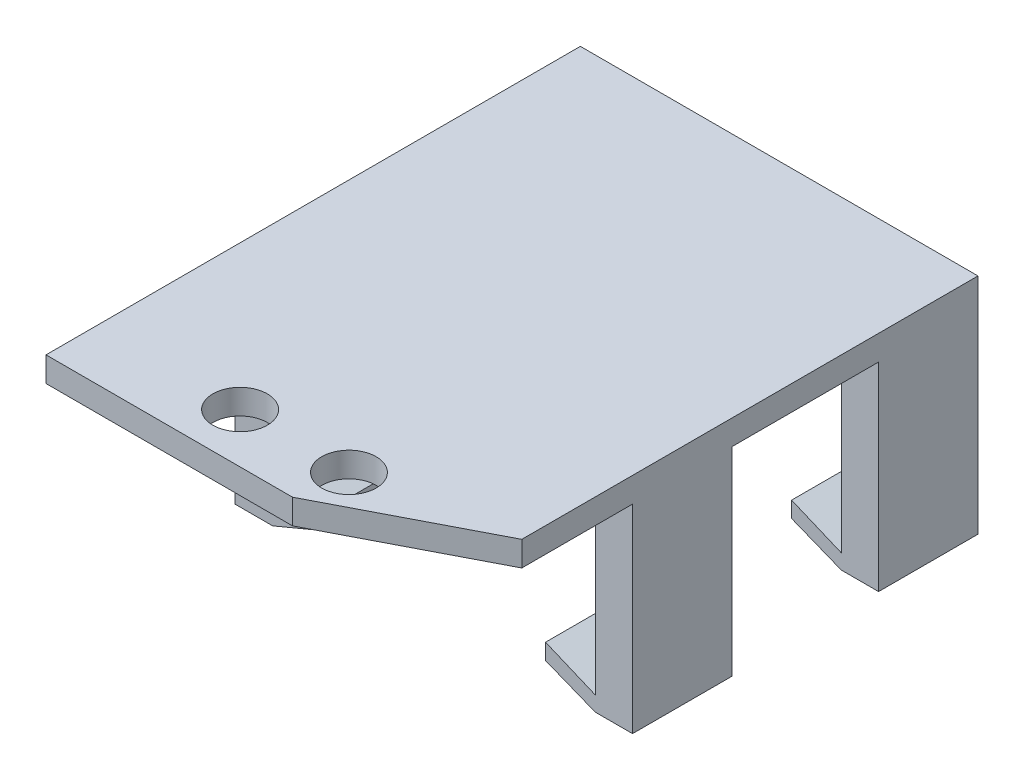
ISO-10303-21;
HEADER;
FILE_DESCRIPTION(('STEP AP214'),'2;1');
FILE_NAME('part.step','',(''),(''),'','','');
FILE_SCHEMA(('AUTOMOTIVE_DESIGN { 1 0 10303 214 1 1 1 1 }'));
ENDSEC;
DATA;
#1=APPLICATION_CONTEXT('core data for automotive mechanical design processes');
#2=APPLICATION_PROTOCOL_DEFINITION('international standard','automotive_design',2000,#1);
#3=PRODUCT_CONTEXT('',#1,'mechanical');
#4=PRODUCT('Part','Part','',(#3));
#5=PRODUCT_RELATED_PRODUCT_CATEGORY('part','',(#4));
#6=PRODUCT_DEFINITION_FORMATION('','',#4);
#7=PRODUCT_DEFINITION_CONTEXT('part definition',#1,'design');
#8=PRODUCT_DEFINITION('design','',#6,#7);
#9=PRODUCT_DEFINITION_SHAPE('','',#8);
#10=(LENGTH_UNIT() NAMED_UNIT(*) SI_UNIT(.MILLI.,.METRE.));
#11=(NAMED_UNIT(*) PLANE_ANGLE_UNIT() SI_UNIT($,.RADIAN.));
#12=(NAMED_UNIT(*) SI_UNIT($,.STERADIAN.) SOLID_ANGLE_UNIT());
#13=UNCERTAINTY_MEASURE_WITH_UNIT(LENGTH_MEASURE(1.E-05),#10,'distance_accuracy_value','');
#14=(GEOMETRIC_REPRESENTATION_CONTEXT(3) GLOBAL_UNCERTAINTY_ASSIGNED_CONTEXT((#13)) GLOBAL_UNIT_ASSIGNED_CONTEXT((#10,
#11,#12)) REPRESENTATION_CONTEXT('',''));
#15=CARTESIAN_POINT('',(0.,0.,0.));
#16=DIRECTION('',(0.,0.,1.));
#17=DIRECTION('',(1.,0.,0.));
#18=AXIS2_PLACEMENT_3D('',#15,#16,#17);
#19=CARTESIAN_POINT('',(0.,0.,0.));
#20=DIRECTION('',(0.,1.,0.));
#21=DIRECTION('',(0.,0.,1.));
#22=AXIS2_PLACEMENT_3D('',#19,#20,#21);
#23=PLANE('',#22);
#24=CARTESIAN_POINT('',(14.3653480916031,0.,37.0890162162027));
#25=DIRECTION('',(0.,1.,0.));
#26=DIRECTION('',(0.,0.,1.));
#27=AXIS2_PLACEMENT_3D('',#24,#25,#26);
#28=CIRCLE('',#27,2.7813);
#29=CARTESIAN_POINT('',(14.3653480916031,0.,39.8703162162027));
#30=VERTEX_POINT('',#29);
#31=EDGE_CURVE('E416',#30,#30,#28,.T.);
#32=ORIENTED_EDGE('',*,*,#31,.T.);
#33=EDGE_LOOP('',(#32));
#34=FACE_BOUND('',#33,.T.);
#35=CARTESIAN_POINT('',(3.24014809160307,0.,37.0890162162027));
#36=DIRECTION('',(0.,1.,0.));
#37=DIRECTION('',(0.,0.,1.));
#38=AXIS2_PLACEMENT_3D('',#35,#36,#37);
#39=CIRCLE('',#38,2.7813);
#40=CARTESIAN_POINT('',(3.24014809160307,0.,39.8703162162027));
#41=VERTEX_POINT('',#40);
#42=EDGE_CURVE('E420',#41,#41,#39,.T.);
#43=ORIENTED_EDGE('',*,*,#42,.T.);
#44=EDGE_LOOP('',(#43));
#45=FACE_BOUND('',#44,.T.);
#46=DIRECTION('',(0.888278607187186,0.,-0.459305035911423));
#47=VECTOR('',#46,1.);
#48=CARTESIAN_POINT('',(20.0901524205388,0.,38.8535966623628));
#49=LINE('',#48,#47);
#50=CARTESIAN_POINT('',(13.6782561135843,0.,42.1690162162027));
#51=VERTEX_POINT('',#50);
#52=CARTESIAN_POINT('',(29.1227480916031,0.,34.1830837787881));
#53=VERTEX_POINT('',#52);
#54=EDGE_CURVE('E51',#51,#53,#49,.T.);
#55=ORIENTED_EDGE('',*,*,#54,.F.);
#56=DIRECTION('',(1.,0.,0.));
#57=VECTOR('',#56,1.);
#58=CARTESIAN_POINT('',(18.8852561135843,0.,42.1690162162027));
#59=LINE('',#58,#57);
#60=CARTESIAN_POINT('',(-11.5172519083969,0.,42.1690162162027));
#61=VERTEX_POINT('',#60);
#62=EDGE_CURVE('E252',#61,#51,#59,.T.);
#63=ORIENTED_EDGE('',*,*,#62,.F.);
#64=DIRECTION('',(0.,0.,1.));
#65=VECTOR('',#64,1.);
#66=CARTESIAN_POINT('',(-11.5172519083969,0.,-12.4409837837973));
#67=LINE('',#66,#65);
#68=CARTESIAN_POINT('',(-11.5172519083969,0.,22.8650162162027));
#69=VERTEX_POINT('',#68);
#70=EDGE_CURVE('E268',#69,#61,#67,.T.);
#71=ORIENTED_EDGE('',*,*,#70,.F.);
#72=DIRECTION('',(-1.,0.,0.));
#73=VECTOR('',#72,1.);
#74=CARTESIAN_POINT('',(-11.5172519083969,0.,22.8650162162027));
#75=LINE('',#74,#73);
#76=CARTESIAN_POINT('',(29.1227480916031,0.,22.8650162162027));
#77=VERTEX_POINT('',#76);
#78=EDGE_CURVE('E378',#77,#69,#75,.T.);
#79=ORIENTED_EDGE('',*,*,#78,.F.);
#80=DIRECTION('',(0.,0.,-1.));
#81=VECTOR('',#80,1.);
#82=CARTESIAN_POINT('',(29.1227480916031,0.,-12.4409837837973));
#83=LINE('',#82,#81);
#84=EDGE_CURVE('E262',#53,#77,#83,.T.);
#85=ORIENTED_EDGE('',*,*,#84,.F.);
#86=EDGE_LOOP('',(#55,#63,#71,#79,#85));
#87=FACE_BOUND('',#86,.T.);
#88=ADVANCED_FACE('F37',(#34,#45,#87),#23,.F.);
#89=CARTESIAN_POINT('',(0.,2.54,0.));
#90=DIRECTION('',(0.,1.,0.));
#91=DIRECTION('',(0.,0.,1.));
#92=AXIS2_PLACEMENT_3D('',#89,#90,#91);
#93=PLANE('',#92);
#94=CARTESIAN_POINT('',(3.24014809160307,2.54,37.0890162162027));
#95=DIRECTION('',(0.,1.,0.));
#96=DIRECTION('',(0.,0.,1.));
#97=AXIS2_PLACEMENT_3D('',#94,#95,#96);
#98=CIRCLE('',#97,2.7813);
#99=CARTESIAN_POINT('',(3.24014809160307,2.54,39.8703162162027));
#100=VERTEX_POINT('',#99);
#101=EDGE_CURVE('E270',#100,#100,#98,.T.);
#102=ORIENTED_EDGE('',*,*,#101,.F.);
#103=EDGE_LOOP('',(#102));
#104=FACE_BOUND('',#103,.T.);
#105=CARTESIAN_POINT('',(14.3653480916031,2.54,37.0890162162027));
#106=DIRECTION('',(0.,1.,0.));
#107=DIRECTION('',(0.,0.,1.));
#108=AXIS2_PLACEMENT_3D('',#105,#106,#107);
#109=CIRCLE('',#108,2.7813);
#110=CARTESIAN_POINT('',(14.3653480916031,2.54,39.8703162162027));
#111=VERTEX_POINT('',#110);
#112=EDGE_CURVE('E417',#111,#111,#109,.T.);
#113=ORIENTED_EDGE('',*,*,#112,.F.);
#114=EDGE_LOOP('',(#113));
#115=FACE_BOUND('',#114,.T.);
#116=DIRECTION('',(1.,0.,0.));
#117=VECTOR('',#116,1.);
#118=CARTESIAN_POINT('',(-11.5172519083969,2.54,42.1690162162027));
#119=LINE('',#118,#117);
#120=CARTESIAN_POINT('',(-11.5172519083969,2.54,42.1690162162027));
#121=VERTEX_POINT('',#120);
#122=CARTESIAN_POINT('',(13.6782561135843,2.54,42.1690162162027));
#123=VERTEX_POINT('',#122);
#124=EDGE_CURVE('E249',#121,#123,#119,.T.);
#125=ORIENTED_EDGE('',*,*,#124,.T.);
#126=DIRECTION('',(0.888278607187186,0.,-0.459305035911423));
#127=VECTOR('',#126,1.);
#128=CARTESIAN_POINT('',(20.0901524205388,2.54,38.8535966623628));
#129=LINE('',#128,#127);
#130=CARTESIAN_POINT('',(29.1227480916031,2.54,34.1830837787881));
#131=VERTEX_POINT('',#130);
#132=EDGE_CURVE('E237',#123,#131,#129,.T.);
#133=ORIENTED_EDGE('',*,*,#132,.T.);
#134=DIRECTION('',(0.,0.,-1.));
#135=VECTOR('',#134,1.);
#136=CARTESIAN_POINT('',(29.1227480916031,2.54,42.1690162162027));
#137=LINE('',#136,#135);
#138=CARTESIAN_POINT('',(29.1227480916031,2.54,-12.4409837837973));
#139=VERTEX_POINT('',#138);
#140=EDGE_CURVE('E258',#131,#139,#137,.T.);
#141=ORIENTED_EDGE('',*,*,#140,.T.);
#142=DIRECTION('',(-1.,0.,0.));
#143=VECTOR('',#142,1.);
#144=CARTESIAN_POINT('',(-11.5172519083969,2.54,-12.4409837837973));
#145=LINE('',#144,#143);
#146=CARTESIAN_POINT('',(-11.5172519083969,2.54,-12.4409837837973));
#147=VERTEX_POINT('',#146);
#148=EDGE_CURVE('E260',#139,#147,#145,.T.);
#149=ORIENTED_EDGE('',*,*,#148,.T.);
#150=DIRECTION('',(0.,0.,1.));
#151=VECTOR('',#150,1.);
#152=CARTESIAN_POINT('',(-11.5172519083969,2.54,-12.4409837837973));
#153=LINE('',#152,#151);
#154=EDGE_CURVE('E256',#147,#121,#153,.T.);
#155=ORIENTED_EDGE('',*,*,#154,.T.);
#156=EDGE_LOOP('',(#125,#133,#141,#149,#155));
#157=FACE_BOUND('',#156,.T.);
#158=ADVANCED_FACE('F254',(#104,#115,#157),#93,.T.);
#159=CARTESIAN_POINT('',(18.8852561135843,2.54,42.1690162162027));
#160=DIRECTION('',(0.,0.,-1.));
#161=DIRECTION('',(-1.,0.,0.));
#162=AXIS2_PLACEMENT_3D('',#159,#160,#161);
#163=PLANE('',#162);
#164=DIRECTION('',(0.,1.,0.));
#165=VECTOR('',#164,1.);
#166=CARTESIAN_POINT('',(13.6782561135843,-20.32,42.1690162162027));
#167=LINE('',#166,#165);
#168=EDGE_CURVE('E240',#51,#123,#167,.T.);
#169=ORIENTED_EDGE('',*,*,#168,.T.);
#170=ORIENTED_EDGE('',*,*,#124,.F.);
#171=DIRECTION('',(0.,-1.,0.));
#172=VECTOR('',#171,1.);
#173=CARTESIAN_POINT('',(-11.5172519083969,2.54,42.1690162162027));
#174=LINE('',#173,#172);
#175=EDGE_CURVE('E278',#121,#61,#174,.T.);
#176=ORIENTED_EDGE('',*,*,#175,.T.);
#177=ORIENTED_EDGE('',*,*,#62,.T.);
#178=EDGE_LOOP('',(#169,#170,#176,#177));
#179=FACE_BOUND('',#178,.T.);
#180=ADVANCED_FACE('F247',(#179),#163,.F.);
#181=CARTESIAN_POINT('',(29.1227480916031,2.54,-12.4409837837973));
#182=DIRECTION('',(-1.,0.,0.));
#183=DIRECTION('',(0.,0.,1.));
#184=AXIS2_PLACEMENT_3D('',#181,#182,#183);
#185=PLANE('',#184);
#186=DIRECTION('',(0.,1.,0.));
#187=VECTOR('',#186,1.);
#188=CARTESIAN_POINT('',(29.1227480916031,2.54,34.1830837787881));
#189=LINE('',#188,#187);
#190=EDGE_CURVE('E11',#53,#131,#189,.T.);
#191=ORIENTED_EDGE('',*,*,#190,.F.);
#192=ORIENTED_EDGE('',*,*,#84,.T.);
#193=DIRECTION('',(0.,1.,0.));
#194=VECTOR('',#193,1.);
#195=CARTESIAN_POINT('',(29.1227480916031,0.,22.8650162162027));
#196=LINE('',#195,#194);
#197=CARTESIAN_POINT('',(29.1227480916031,-20.32,22.8650162162027));
#198=VERTEX_POINT('',#197);
#199=EDGE_CURVE('E375',#198,#77,#196,.T.);
#200=ORIENTED_EDGE('',*,*,#199,.F.);
#201=DIRECTION('',(0.,0.,1.));
#202=VECTOR('',#201,1.);
#203=CARTESIAN_POINT('',(29.1227480916031,-20.32,27.9450162162027));
#204=LINE('',#203,#202);
#205=CARTESIAN_POINT('',(29.1227480916031,-20.32,12.7050162162027));
#206=VERTEX_POINT('',#205);
#207=EDGE_CURVE('E402',#206,#198,#204,.T.);
#208=ORIENTED_EDGE('',*,*,#207,.F.);
#209=DIRECTION('',(0.,-1.,0.));
#210=VECTOR('',#209,1.);
#211=CARTESIAN_POINT('',(29.1227480916031,-20.32,12.7050162162027));
#212=LINE('',#211,#210);
#213=CARTESIAN_POINT('',(29.1227480916031,0.,12.7050162162027));
#214=VERTEX_POINT('',#213);
#215=EDGE_CURVE('E916',#214,#206,#212,.T.);
#216=ORIENTED_EDGE('',*,*,#215,.F.);
#217=DIRECTION('',(0.,0.,1.));
#218=VECTOR('',#217,1.);
#219=CARTESIAN_POINT('',(29.1227480916031,0.,-2.28098378379732));
#220=LINE('',#219,#218);
#221=CARTESIAN_POINT('',(29.1227480916031,0.,-2.28098378379732));
#222=VERTEX_POINT('',#221);
#223=EDGE_CURVE('E962',#222,#214,#220,.T.);
#224=ORIENTED_EDGE('',*,*,#223,.F.);
#225=DIRECTION('',(0.,1.,0.));
#226=VECTOR('',#225,1.);
#227=CARTESIAN_POINT('',(29.1227480916031,-20.32,-2.28098378379732));
#228=LINE('',#227,#226);
#229=CARTESIAN_POINT('',(29.1227480916031,-20.32,-2.28098378379732));
#230=VERTEX_POINT('',#229);
#231=EDGE_CURVE('E898',#230,#222,#228,.T.);
#232=ORIENTED_EDGE('',*,*,#231,.F.);
#233=CARTESIAN_POINT('',(29.1227480916031,-20.32,-12.4409837837973));
#234=VERTEX_POINT('',#233);
#235=EDGE_CURVE('E403',#234,#230,#204,.T.);
#236=ORIENTED_EDGE('',*,*,#235,.F.);
#237=DIRECTION('',(0.,-1.,0.));
#238=VECTOR('',#237,1.);
#239=CARTESIAN_POINT('',(29.1227480916031,2.54,-12.4409837837973));
#240=LINE('',#239,#238);
#241=EDGE_CURVE('E275',#139,#234,#240,.T.);
#242=ORIENTED_EDGE('',*,*,#241,.F.);
#243=ORIENTED_EDGE('',*,*,#140,.F.);
#244=EDGE_LOOP('',(#191,#192,#200,#208,#216,#224,#232,#236,#242,#243));
#245=FACE_BOUND('',#244,.T.);
#246=ADVANCED_FACE('F458',(#245),#185,.F.);
#247=CARTESIAN_POINT('',(0.,-20.32,0.));
#248=DIRECTION('',(0.,-1.,0.));
#249=DIRECTION('',(0.,0.,-1.));
#250=AXIS2_PLACEMENT_3D('',#247,#248,#249);
#251=PLANE('',#250);
#252=DIRECTION('',(1.,0.,0.));
#253=VECTOR('',#252,1.);
#254=CARTESIAN_POINT('',(-11.5172519083969,-20.32,-12.4409837837973));
#255=LINE('',#254,#253);
#256=CARTESIAN_POINT('',(-11.5172519083969,-20.32,-12.4409837837973));
#257=VERTEX_POINT('',#256);
#258=CARTESIAN_POINT('',(-7.66074574714831,-20.32,-12.4409837837973));
#259=VERTEX_POINT('',#258);
#260=EDGE_CURVE('E410',#257,#259,#255,.T.);
#261=ORIENTED_EDGE('',*,*,#260,.T.);
#262=DIRECTION('',(0.,0.,1.));
#263=VECTOR('',#262,1.);
#264=CARTESIAN_POINT('',(-7.66074574714831,-20.32,-12.4409837837973));
#265=LINE('',#264,#263);
#266=CARTESIAN_POINT('',(-7.66074574714831,-20.32,-2.28098378379731));
#267=VERTEX_POINT('',#266);
#268=EDGE_CURVE('E307',#259,#267,#265,.T.);
#269=ORIENTED_EDGE('',*,*,#268,.T.);
#270=DIRECTION('',(1.,0.,0.));
#271=VECTOR('',#270,1.);
#272=CARTESIAN_POINT('',(-11.517251908397,-20.32,-2.28098378379731));
#273=LINE('',#272,#271);
#274=CARTESIAN_POINT('',(-11.517251908397,-20.32,-2.28098378379731));
#275=VERTEX_POINT('',#274);
#276=EDGE_CURVE('E902',#275,#267,#273,.T.);
#277=ORIENTED_EDGE('',*,*,#276,.F.);
#278=DIRECTION('',(0.,0.,-1.));
#279=VECTOR('',#278,1.);
#280=CARTESIAN_POINT('',(-11.5172519083969,-20.32,27.9450162162027));
#281=LINE('',#280,#279);
#282=EDGE_CURVE('E406',#275,#257,#281,.T.);
#283=ORIENTED_EDGE('',*,*,#282,.T.);
#284=EDGE_LOOP('',(#261,#269,#277,#283));
#285=FACE_BOUND('',#284,.T.);
#286=ADVANCED_FACE('F460',(#285),#251,.T.);
#287=CARTESIAN_POINT('',(0.,-20.32,0.));
#288=DIRECTION('',(0.,1.,0.));
#289=DIRECTION('',(0.,0.,1.));
#290=AXIS2_PLACEMENT_3D('',#287,#288,#289);
#291=PLANE('',#290);
#292=DIRECTION('',(0.,0.,1.));
#293=VECTOR('',#292,1.);
#294=CARTESIAN_POINT('',(25.3127480916031,-20.32,-12.4409837837973));
#295=LINE('',#294,#293);
#296=CARTESIAN_POINT('',(25.3127480916031,-20.32,-12.4409837837973));
#297=VERTEX_POINT('',#296);
#298=CARTESIAN_POINT('',(25.3127480916031,-20.32,-2.28098378379732));
#299=VERTEX_POINT('',#298);
#300=EDGE_CURVE('E59',#297,#299,#295,.T.);
#301=ORIENTED_EDGE('',*,*,#300,.F.);
#302=DIRECTION('',(1.,0.,0.));
#303=VECTOR('',#302,1.);
#304=CARTESIAN_POINT('',(29.1227480916031,-20.32,-12.4409837837973));
#305=LINE('',#304,#303);
#306=EDGE_CURVE('E400',#297,#234,#305,.T.);
#307=ORIENTED_EDGE('',*,*,#306,.T.);
#308=ORIENTED_EDGE('',*,*,#235,.T.);
#309=EDGE_CURVE('E909',#299,#230,#273,.T.);
#310=ORIENTED_EDGE('',*,*,#309,.F.);
#311=EDGE_LOOP('',(#301,#307,#308,#310));
#312=FACE_BOUND('',#311,.T.);
#313=ADVANCED_FACE('F478',(#312),#291,.F.);
#314=CARTESIAN_POINT('',(20.2327480916031,0.,0.));
#315=DIRECTION('',(-1.,0.,0.));
#316=DIRECTION('',(0.,0.,1.));
#317=AXIS2_PLACEMENT_3D('',#314,#315,#316);
#318=PLANE('',#317);
#319=DIRECTION('',(0.,-1.,0.));
#320=VECTOR('',#319,1.);
#321=CARTESIAN_POINT('',(20.2327480916031,-18.796,-12.4409837837973));
#322=LINE('',#321,#320);
#323=CARTESIAN_POINT('',(20.2327480916031,-16.6688197799885,-12.4409837837973));
#324=VERTEX_POINT('',#323);
#325=CARTESIAN_POINT('',(20.2327480916031,-18.2946026362876,-12.4409837837973));
#326=VERTEX_POINT('',#325);
#327=EDGE_CURVE('E387',#324,#326,#322,.T.);
#328=ORIENTED_EDGE('',*,*,#327,.T.);
#329=DIRECTION('',(0.,0.,1.));
#330=VECTOR('',#329,1.);
#331=CARTESIAN_POINT('',(20.2327480916031,-18.2946026362876,-12.4409837837973));
#332=LINE('',#331,#330);
#333=CARTESIAN_POINT('',(20.2327480916031,-18.2946026362876,-2.28098378379732));
#334=VERTEX_POINT('',#333);
#335=EDGE_CURVE('E951',#326,#334,#332,.T.);
#336=ORIENTED_EDGE('',*,*,#335,.T.);
#337=DIRECTION('',(0.,-1.,0.));
#338=VECTOR('',#337,1.);
#339=CARTESIAN_POINT('',(20.2327480916031,0.,-2.28098378379732));
#340=LINE('',#339,#338);
#341=CARTESIAN_POINT('',(20.2327480916031,-16.6688197799885,-2.28098378379732));
#342=VERTEX_POINT('',#341);
#343=EDGE_CURVE('E312',#342,#334,#340,.T.);
#344=ORIENTED_EDGE('',*,*,#343,.F.);
#345=DIRECTION('',(0.,0.,1.));
#346=VECTOR('',#345,1.);
#347=CARTESIAN_POINT('',(20.2327480916031,-16.6688197799885,-17.9796028196735));
#348=LINE('',#347,#346);
#349=EDGE_CURVE('E336',#324,#342,#348,.T.);
#350=ORIENTED_EDGE('',*,*,#349,.F.);
#351=EDGE_LOOP('',(#328,#336,#344,#350));
#352=FACE_BOUND('',#351,.T.);
#353=ADVANCED_FACE('F488',(#352),#318,.T.);
#354=CARTESIAN_POINT('',(-2.59340745083259,-16.6688197799885,-17.9796028196735));
#355=DIRECTION('',(0.999873452344455,-0.0159084661982284,0.));
#356=DIRECTION('',(0.0159084661982284,0.999873452344455,0.));
#357=AXIS2_PLACEMENT_3D('',#354,#355,#356);
#358=PLANE('',#357);
#359=DIRECTION('',(0.0159084661982284,0.999873452344455,0.));
#360=VECTOR('',#359,1.);
#361=CARTESIAN_POINT('',(-2.59340745083259,-16.6688197799885,-2.28098378379732));
#362=LINE('',#361,#360);
#363=CARTESIAN_POINT('',(-2.61803166417197,-18.2164923774667,-2.28098378379732));
#364=VERTEX_POINT('',#363);
#365=CARTESIAN_POINT('',(-2.59340745083259,-16.6688197799885,-2.28098378379731));
#366=VERTEX_POINT('',#365);
#367=EDGE_CURVE('E330',#364,#366,#362,.T.);
#368=ORIENTED_EDGE('',*,*,#367,.F.);
#369=DIRECTION('',(0.,0.,1.));
#370=VECTOR('',#369,1.);
#371=CARTESIAN_POINT('',(-2.61803166417197,-18.2164923774667,-12.4409837837973));
#372=LINE('',#371,#370);
#373=CARTESIAN_POINT('',(-2.61803166417197,-18.2164923774667,-12.4409837837973));
#374=VERTEX_POINT('',#373);
#375=EDGE_CURVE('E306',#374,#364,#372,.T.);
#376=ORIENTED_EDGE('',*,*,#375,.F.);
#377=DIRECTION('',(-0.0159084661982284,-0.999873452344455,0.));
#378=VECTOR('',#377,1.);
#379=CARTESIAN_POINT('',(-2.59340745083259,-16.6688197799885,-12.4409837837973));
#380=LINE('',#379,#378);
#381=CARTESIAN_POINT('',(-2.59340745083259,-16.6688197799885,-12.4409837837973));
#382=VERTEX_POINT('',#381);
#383=EDGE_CURVE('E344',#382,#374,#380,.T.);
#384=ORIENTED_EDGE('',*,*,#383,.F.);
#385=DIRECTION('',(0.,0.,1.));
#386=VECTOR('',#385,1.);
#387=CARTESIAN_POINT('',(-2.59340745083259,-16.6688197799885,-17.9796028196735));
#388=LINE('',#387,#386);
#389=EDGE_CURVE('E345',#382,#366,#388,.T.);
#390=ORIENTED_EDGE('',*,*,#389,.T.);
#391=EDGE_LOOP('',(#368,#376,#384,#390));
#392=FACE_BOUND('',#391,.T.);
#393=ADVANCED_FACE('F497',(#392),#358,.T.);
#394=DIRECTION('',(1.,0.,0.));
#395=VECTOR('',#394,1.);
#396=CARTESIAN_POINT('',(-11.517251908397,-20.32,12.7050162162027));
#397=LINE('',#396,#395);
#398=CARTESIAN_POINT('',(-11.517251908397,-20.32,12.7050162162027));
#399=VERTEX_POINT('',#398);
#400=CARTESIAN_POINT('',(-7.66074574714831,-20.32,12.7050162162027));
#401=VERTEX_POINT('',#400);
#402=EDGE_CURVE('E913',#399,#401,#397,.T.);
#403=ORIENTED_EDGE('',*,*,#402,.T.);
#404=CARTESIAN_POINT('',(-7.66074574714831,-20.32,22.8650162162027));
#405=VERTEX_POINT('',#404);
#406=EDGE_CURVE('E294',#401,#405,#265,.T.);
#407=ORIENTED_EDGE('',*,*,#406,.T.);
#408=DIRECTION('',(1.,0.,0.));
#409=VECTOR('',#408,1.);
#410=CARTESIAN_POINT('',(-11.5172519083969,-20.32,22.8650162162027));
#411=LINE('',#410,#409);
#412=CARTESIAN_POINT('',(-11.5172519083969,-20.32,22.8650162162027));
#413=VERTEX_POINT('',#412);
#414=EDGE_CURVE('E372',#413,#405,#411,.T.);
#415=ORIENTED_EDGE('',*,*,#414,.F.);
#416=EDGE_CURVE('E407',#413,#399,#281,.T.);
#417=ORIENTED_EDGE('',*,*,#416,.T.);
#418=EDGE_LOOP('',(#403,#407,#415,#417));
#419=FACE_BOUND('',#418,.T.);
#420=ADVANCED_FACE('F481',(#419),#251,.T.);
#421=CARTESIAN_POINT('',(25.3127480916031,-20.32,12.7050162162027));
#422=VERTEX_POINT('',#421);
#423=CARTESIAN_POINT('',(25.3127480916031,-20.32,22.8650162162027));
#424=VERTEX_POINT('',#423);
#425=EDGE_CURVE('E941',#422,#424,#295,.T.);
#426=ORIENTED_EDGE('',*,*,#425,.F.);
#427=EDGE_CURVE('E919',#422,#206,#397,.T.);
#428=ORIENTED_EDGE('',*,*,#427,.T.);
#429=ORIENTED_EDGE('',*,*,#207,.T.);
#430=EDGE_CURVE('E371',#424,#198,#411,.T.);
#431=ORIENTED_EDGE('',*,*,#430,.F.);
#432=EDGE_LOOP('',(#426,#428,#429,#431));
#433=FACE_BOUND('',#432,.T.);
#434=ADVANCED_FACE('F491',(#433),#291,.F.);
#435=DIRECTION('',(0.,1.,0.));
#436=VECTOR('',#435,1.);
#437=CARTESIAN_POINT('',(20.2327480916031,0.,12.7050162162027));
#438=LINE('',#437,#436);
#439=CARTESIAN_POINT('',(20.2327480916031,-18.2946026362876,12.7050162162027));
#440=VERTEX_POINT('',#439);
#441=CARTESIAN_POINT('',(20.2327480916031,-16.6688197799885,12.7050162162027));
#442=VERTEX_POINT('',#441);
#443=EDGE_CURVE('E908',#440,#442,#438,.T.);
#444=ORIENTED_EDGE('',*,*,#443,.F.);
#445=CARTESIAN_POINT('',(20.2327480916031,-18.2946026362876,22.8650162162027));
#446=VERTEX_POINT('',#445);
#447=EDGE_CURVE('E947',#440,#446,#332,.T.);
#448=ORIENTED_EDGE('',*,*,#447,.T.);
#449=DIRECTION('',(0.,1.,0.));
#450=VECTOR('',#449,1.);
#451=CARTESIAN_POINT('',(20.2327480916031,0.,22.8650162162027));
#452=LINE('',#451,#450);
#453=CARTESIAN_POINT('',(20.2327480916031,-16.6688197799885,22.8650162162027));
#454=VERTEX_POINT('',#453);
#455=EDGE_CURVE('E280',#446,#454,#452,.T.);
#456=ORIENTED_EDGE('',*,*,#455,.T.);
#457=EDGE_CURVE('E335',#442,#454,#348,.T.);
#458=ORIENTED_EDGE('',*,*,#457,.F.);
#459=EDGE_LOOP('',(#444,#448,#456,#458));
#460=FACE_BOUND('',#459,.T.);
#461=ADVANCED_FACE('F456',(#460),#318,.T.);
#462=CARTESIAN_POINT('',(-11.5172519083969,2.54,-12.4409837837973));
#463=DIRECTION('',(0.,0.,1.));
#464=DIRECTION('',(1.,0.,0.));
#465=AXIS2_PLACEMENT_3D('',#462,#463,#464);
#466=PLANE('',#465);
#467=DIRECTION('',(0.922922412237394,0.384986001031089,0.));
#468=VECTOR('',#467,1.);
#469=CARTESIAN_POINT('',(6.08451261866922,-14.5863305373994,-12.4409837837973));
#470=LINE('',#469,#468);
#471=EDGE_CURVE('E938',#259,#374,#470,.T.);
#472=ORIENTED_EDGE('',*,*,#471,.F.);
#473=ORIENTED_EDGE('',*,*,#260,.F.);
#474=DIRECTION('',(0.,-1.,0.));
#475=VECTOR('',#474,1.);
#476=CARTESIAN_POINT('',(-11.5172519083969,2.54,-12.4409837837973));
#477=LINE('',#476,#475);
#478=EDGE_CURVE('E267',#147,#257,#477,.T.);
#479=ORIENTED_EDGE('',*,*,#478,.F.);
#480=ORIENTED_EDGE('',*,*,#148,.F.);
#481=ORIENTED_EDGE('',*,*,#241,.T.);
#482=ORIENTED_EDGE('',*,*,#306,.F.);
#483=DIRECTION('',(0.928892421611158,-0.370349657855058,0.));
#484=VECTOR('',#483,1.);
#485=CARTESIAN_POINT('',(-3.51851670614279,-8.82496698546269,-12.4409837837973));
#486=LINE('',#485,#484);
#487=EDGE_CURVE('E945',#326,#297,#486,.T.);
#488=ORIENTED_EDGE('',*,*,#487,.F.);
#489=ORIENTED_EDGE('',*,*,#327,.F.);
#490=DIRECTION('',(0.922397741391246,-0.386241383950928,0.));
#491=VECTOR('',#490,1.);
#492=CARTESIAN_POINT('',(20.2327480916031,-16.6688197799885,-12.4409837837973));
#493=LINE('',#492,#491);
#494=CARTESIAN_POINT('',(25.3127480916031,-18.796,-12.4409837837973));
#495=VERTEX_POINT('',#494);
#496=EDGE_CURVE('E332',#324,#495,#493,.T.);
#497=ORIENTED_EDGE('',*,*,#496,.T.);
#498=DIRECTION('',(0.,1.,0.));
#499=VECTOR('',#498,1.);
#500=CARTESIAN_POINT('',(25.3127480916031,-20.32,-12.4409837837973));
#501=LINE('',#500,#499);
#502=CARTESIAN_POINT('',(25.3127480916031,-2.9718,-12.4409837837973));
#503=VERTEX_POINT('',#502);
#504=EDGE_CURVE('E397',#495,#503,#501,.T.);
#505=ORIENTED_EDGE('',*,*,#504,.T.);
#506=DIRECTION('',(1.,0.,0.));
#507=VECTOR('',#506,1.);
#508=CARTESIAN_POINT('',(-11.5172519083969,-2.9718,-12.4409837837973));
#509=LINE('',#508,#507);
#510=CARTESIAN_POINT('',(-7.70725190839694,-2.9718,-12.4409837837973));
#511=VERTEX_POINT('',#510);
#512=EDGE_CURVE('E355',#511,#503,#509,.T.);
#513=ORIENTED_EDGE('',*,*,#512,.F.);
#514=DIRECTION('',(0.,1.,0.));
#515=VECTOR('',#514,1.);
#516=CARTESIAN_POINT('',(-7.70725190839694,-20.32,-12.4409837837973));
#517=LINE('',#516,#515);
#518=CARTESIAN_POINT('',(-7.70725190839694,-18.796,-12.4409837837973));
#519=VERTEX_POINT('',#518);
#520=EDGE_CURVE('E413',#519,#511,#517,.T.);
#521=ORIENTED_EDGE('',*,*,#520,.F.);
#522=DIRECTION('',(0.923306770954936,0.384063284770582,0.));
#523=VECTOR('',#522,1.);
#524=CARTESIAN_POINT('',(-7.70725190839694,-18.796,-12.4409837837973));
#525=LINE('',#524,#523);
#526=EDGE_CURVE('E342',#519,#382,#525,.T.);
#527=ORIENTED_EDGE('',*,*,#526,.T.);
#528=ORIENTED_EDGE('',*,*,#383,.T.);
#529=EDGE_LOOP('',(#472,#473,#479,#480,#481,#482,#488,#489,#497,#505,#513,#521,#527,#528));
#530=FACE_BOUND('',#529,.T.);
#531=ADVANCED_FACE('F452',(#530),#466,.F.);
#532=CARTESIAN_POINT('',(0.,0.,22.8650162162027));
#533=DIRECTION('',(0.,0.,1.));
#534=DIRECTION('',(1.,0.,0.));
#535=AXIS2_PLACEMENT_3D('',#532,#533,#534);
#536=PLANE('',#535);
#537=ORIENTED_EDGE('',*,*,#414,.T.);
#538=DIRECTION('',(0.922922412237394,0.384986001031089,0.));
#539=VECTOR('',#538,1.);
#540=CARTESIAN_POINT('',(6.08451261866922,-14.5863305373994,22.8650162162027));
#541=LINE('',#540,#539);
#542=CARTESIAN_POINT('',(-2.61803166417197,-18.2164923774667,22.8650162162027));
#543=VERTEX_POINT('',#542);
#544=EDGE_CURVE('E936',#405,#543,#541,.T.);
#545=ORIENTED_EDGE('',*,*,#544,.T.);
#546=DIRECTION('',(0.0159084661982284,0.999873452344455,0.));
#547=VECTOR('',#546,1.);
#548=CARTESIAN_POINT('',(-2.59340745083259,-16.6688197799885,22.8650162162027));
#549=LINE('',#548,#547);
#550=CARTESIAN_POINT('',(-2.59340745083259,-16.6688197799885,22.8650162162027));
#551=VERTEX_POINT('',#550);
#552=EDGE_CURVE('E305',#543,#551,#549,.T.);
#553=ORIENTED_EDGE('',*,*,#552,.T.);
#554=DIRECTION('',(-0.923306770954936,-0.384063284770582,0.));
#555=VECTOR('',#554,1.);
#556=CARTESIAN_POINT('',(-7.70725190839694,-18.796,22.8650162162027));
#557=LINE('',#556,#555);
#558=CARTESIAN_POINT('',(-7.70725190839694,-18.796,22.8650162162027));
#559=VERTEX_POINT('',#558);
#560=EDGE_CURVE('E347',#551,#559,#557,.T.);
#561=ORIENTED_EDGE('',*,*,#560,.T.);
#562=DIRECTION('',(0.,1.,0.));
#563=VECTOR('',#562,1.);
#564=CARTESIAN_POINT('',(-7.70725190839694,-20.32,22.8650162162027));
#565=LINE('',#564,#563);
#566=CARTESIAN_POINT('',(-7.70725190839694,-2.9718,22.8650162162027));
#567=VERTEX_POINT('',#566);
#568=EDGE_CURVE('E383',#559,#567,#565,.T.);
#569=ORIENTED_EDGE('',*,*,#568,.T.);
#570=DIRECTION('',(-1.,0.,0.));
#571=VECTOR('',#570,1.);
#572=CARTESIAN_POINT('',(-11.5172519083969,-2.9718,22.8650162162027));
#573=LINE('',#572,#571);
#574=CARTESIAN_POINT('',(25.3127480916031,-2.9718,22.8650162162027));
#575=VERTEX_POINT('',#574);
#576=EDGE_CURVE('E358',#575,#567,#573,.T.);
#577=ORIENTED_EDGE('',*,*,#576,.F.);
#578=DIRECTION('',(0.,-1.,0.));
#579=VECTOR('',#578,1.);
#580=CARTESIAN_POINT('',(25.3127480916031,-20.32,22.8650162162027));
#581=LINE('',#580,#579);
#582=CARTESIAN_POINT('',(25.3127480916031,-18.796,22.8650162162027));
#583=VERTEX_POINT('',#582);
#584=EDGE_CURVE('E380',#575,#583,#581,.T.);
#585=ORIENTED_EDGE('',*,*,#584,.T.);
#586=DIRECTION('',(-0.922397741391246,0.386241383950928,0.));
#587=VECTOR('',#586,1.);
#588=CARTESIAN_POINT('',(20.2327480916031,-16.6688197799885,22.8650162162027));
#589=LINE('',#588,#587);
#590=EDGE_CURVE('E339',#583,#454,#589,.T.);
#591=ORIENTED_EDGE('',*,*,#590,.T.);
#592=ORIENTED_EDGE('',*,*,#455,.F.);
#593=DIRECTION('',(0.928892421611158,-0.370349657855058,0.));
#594=VECTOR('',#593,1.);
#595=CARTESIAN_POINT('',(-3.51851670614279,-8.82496698546269,22.8650162162027));
#596=LINE('',#595,#594);
#597=EDGE_CURVE('E948',#446,#424,#596,.T.);
#598=ORIENTED_EDGE('',*,*,#597,.T.);
#599=ORIENTED_EDGE('',*,*,#430,.T.);
#600=ORIENTED_EDGE('',*,*,#199,.T.);
#601=ORIENTED_EDGE('',*,*,#78,.T.);
#602=DIRECTION('',(0.,-1.,0.));
#603=VECTOR('',#602,1.);
#604=CARTESIAN_POINT('',(-11.5172519083969,0.,22.8650162162027));
#605=LINE('',#604,#603);
#606=EDGE_CURVE('E369',#69,#413,#605,.T.);
#607=ORIENTED_EDGE('',*,*,#606,.T.);
#608=EDGE_LOOP('',(#537,#545,#553,#561,#569,#577,#585,#591,#592,#598,#599,#600,#601,#607));
#609=FACE_BOUND('',#608,.T.);
#610=ADVANCED_FACE('F455',(#609),#536,.T.);
#611=ORIENTED_EDGE('',*,*,#552,.F.);
#612=CARTESIAN_POINT('',(-2.61803166417197,-18.2164923774667,12.7050162162027));
#613=VERTEX_POINT('',#612);
#614=EDGE_CURVE('E291',#613,#543,#372,.T.);
#615=ORIENTED_EDGE('',*,*,#614,.F.);
#616=DIRECTION('',(-0.0159084661982284,-0.999873452344455,0.));
#617=VECTOR('',#616,1.);
#618=CARTESIAN_POINT('',(-2.59340745083259,-16.6688197799885,12.7050162162027));
#619=LINE('',#618,#617);
#620=CARTESIAN_POINT('',(-2.59340745083259,-16.6688197799885,12.7050162162027));
#621=VERTEX_POINT('',#620);
#622=EDGE_CURVE('E303',#621,#613,#619,.T.);
#623=ORIENTED_EDGE('',*,*,#622,.F.);
#624=EDGE_CURVE('E350',#621,#551,#388,.T.);
#625=ORIENTED_EDGE('',*,*,#624,.T.);
#626=EDGE_LOOP('',(#611,#615,#623,#625));
#627=FACE_BOUND('',#626,.T.);
#628=ADVANCED_FACE('F301',(#627),#358,.T.);
#629=CARTESIAN_POINT('',(-11.517251908397,-20.32,-2.28098378379731));
#630=DIRECTION('',(0.,0.,-1.));
#631=DIRECTION('',(-1.,0.,0.));
#632=AXIS2_PLACEMENT_3D('',#629,#630,#631);
#633=PLANE('',#632);
#634=DIRECTION('',(-0.922922412237394,-0.384986001031089,0.));
#635=VECTOR('',#634,1.);
#636=CARTESIAN_POINT('',(-10.9456628519647,-21.6902637222083,-2.28098378379731));
#637=LINE('',#636,#635);
#638=EDGE_CURVE('E892',#364,#267,#637,.T.);
#639=ORIENTED_EDGE('',*,*,#638,.F.);
#640=ORIENTED_EDGE('',*,*,#367,.T.);
#641=DIRECTION('',(-0.923306770954936,-0.384063284770582,0.));
#642=VECTOR('',#641,1.);
#643=CARTESIAN_POINT('',(-7.70725190839694,-18.796,-2.28098378379731));
#644=LINE('',#643,#642);
#645=CARTESIAN_POINT('',(-7.70725190839694,-18.796,-2.28098378379731));
#646=VERTEX_POINT('',#645);
#647=EDGE_CURVE('E328',#366,#646,#644,.T.);
#648=ORIENTED_EDGE('',*,*,#647,.T.);
#649=DIRECTION('',(0.,-1.,0.));
#650=VECTOR('',#649,1.);
#651=CARTESIAN_POINT('',(-7.70725190839694,-20.32,-2.28098378379731));
#652=LINE('',#651,#650);
#653=CARTESIAN_POINT('',(-7.70725190839694,-2.9718,-2.28098378379732));
#654=VERTEX_POINT('',#653);
#655=EDGE_CURVE('E325',#654,#646,#652,.T.);
#656=ORIENTED_EDGE('',*,*,#655,.F.);
#657=DIRECTION('',(1.,0.,0.));
#658=VECTOR('',#657,1.);
#659=CARTESIAN_POINT('',(0.,-2.9718,-2.28098378379732));
#660=LINE('',#659,#658);
#661=CARTESIAN_POINT('',(25.3127480916031,-2.9718,-2.28098378379732));
#662=VERTEX_POINT('',#661);
#663=EDGE_CURVE('E323',#654,#662,#660,.T.);
#664=ORIENTED_EDGE('',*,*,#663,.T.);
#665=DIRECTION('',(0.,1.,0.));
#666=VECTOR('',#665,1.);
#667=CARTESIAN_POINT('',(25.3127480916031,-20.32,-2.28098378379732));
#668=LINE('',#667,#666);
#669=CARTESIAN_POINT('',(25.3127480916031,-18.796,-2.28098378379732));
#670=VERTEX_POINT('',#669);
#671=EDGE_CURVE('E315',#670,#662,#668,.T.);
#672=ORIENTED_EDGE('',*,*,#671,.F.);
#673=DIRECTION('',(-0.922397741391246,0.386241383950928,0.));
#674=VECTOR('',#673,1.);
#675=CARTESIAN_POINT('',(20.2327480916031,-16.6688197799885,-2.28098378379732));
#676=LINE('',#675,#674);
#677=EDGE_CURVE('E284',#670,#342,#676,.T.);
#678=ORIENTED_EDGE('',*,*,#677,.T.);
#679=ORIENTED_EDGE('',*,*,#343,.T.);
#680=DIRECTION('',(-0.928892421611158,0.370349657855058,0.));
#681=VECTOR('',#680,1.);
#682=CARTESIAN_POINT('',(-6.46569076042514,-7.64992789885931,-2.28098378379732));
#683=LINE('',#682,#681);
#684=EDGE_CURVE('E899',#299,#334,#683,.T.);
#685=ORIENTED_EDGE('',*,*,#684,.F.);
#686=ORIENTED_EDGE('',*,*,#309,.T.);
#687=ORIENTED_EDGE('',*,*,#231,.T.);
#688=DIRECTION('',(1.,0.,0.));
#689=VECTOR('',#688,1.);
#690=CARTESIAN_POINT('',(-11.517251908397,0.,-2.28098378379732));
#691=LINE('',#690,#689);
#692=CARTESIAN_POINT('',(-11.517251908397,0.,-2.28098378379732));
#693=VERTEX_POINT('',#692);
#694=EDGE_CURVE('E922',#693,#222,#691,.T.);
#695=ORIENTED_EDGE('',*,*,#694,.F.);
#696=DIRECTION('',(0.,1.,0.));
#697=VECTOR('',#696,1.);
#698=CARTESIAN_POINT('',(-11.517251908397,-20.32,-2.28098378379731));
#699=LINE('',#698,#697);
#700=EDGE_CURVE('E907',#275,#693,#699,.T.);
#701=ORIENTED_EDGE('',*,*,#700,.F.);
#702=ORIENTED_EDGE('',*,*,#276,.T.);
#703=EDGE_LOOP('',(#639,#640,#648,#656,#664,#672,#678,#679,#685,#686,#687,#695,#701,#702));
#704=FACE_BOUND('',#703,.T.);
#705=ADVANCED_FACE('F541',(#704),#633,.F.);
#706=CARTESIAN_POINT('',(-11.517251908397,-20.32,12.7050162162027));
#707=DIRECTION('',(0.,0.,1.));
#708=DIRECTION('',(0.,-1.,0.));
#709=AXIS2_PLACEMENT_3D('',#706,#707,#708);
#710=PLANE('',#709);
#711=DIRECTION('',(0.922922412237394,0.384986001031089,0.));
#712=VECTOR('',#711,1.);
#713=CARTESIAN_POINT('',(-10.9456628519647,-21.6902637222083,12.7050162162027));
#714=LINE('',#713,#712);
#715=EDGE_CURVE('E45',#401,#613,#714,.T.);
#716=ORIENTED_EDGE('',*,*,#715,.F.);
#717=ORIENTED_EDGE('',*,*,#402,.F.);
#718=DIRECTION('',(0.,-1.,0.));
#719=VECTOR('',#718,1.);
#720=CARTESIAN_POINT('',(-11.517251908397,-20.32,12.7050162162027));
#721=LINE('',#720,#719);
#722=CARTESIAN_POINT('',(-11.517251908397,0.,12.7050162162027));
#723=VERTEX_POINT('',#722);
#724=EDGE_CURVE('E923',#723,#399,#721,.T.);
#725=ORIENTED_EDGE('',*,*,#724,.F.);
#726=DIRECTION('',(1.,0.,0.));
#727=VECTOR('',#726,1.);
#728=CARTESIAN_POINT('',(-11.517251908397,0.,12.7050162162027));
#729=LINE('',#728,#727);
#730=EDGE_CURVE('E920',#723,#214,#729,.T.);
#731=ORIENTED_EDGE('',*,*,#730,.T.);
#732=ORIENTED_EDGE('',*,*,#215,.T.);
#733=ORIENTED_EDGE('',*,*,#427,.F.);
#734=DIRECTION('',(0.928892421611158,-0.370349657855058,0.));
#735=VECTOR('',#734,1.);
#736=CARTESIAN_POINT('',(-6.46569076042514,-7.64992789885931,12.7050162162027));
#737=LINE('',#736,#735);
#738=EDGE_CURVE('E286',#440,#422,#737,.T.);
#739=ORIENTED_EDGE('',*,*,#738,.F.);
#740=ORIENTED_EDGE('',*,*,#443,.T.);
#741=DIRECTION('',(0.922397741391246,-0.386241383950928,0.));
#742=VECTOR('',#741,1.);
#743=CARTESIAN_POINT('',(20.2327480916031,-16.6688197799885,12.7050162162027));
#744=LINE('',#743,#742);
#745=CARTESIAN_POINT('',(25.3127480916031,-18.796,12.7050162162027));
#746=VERTEX_POINT('',#745);
#747=EDGE_CURVE('E282',#442,#746,#744,.T.);
#748=ORIENTED_EDGE('',*,*,#747,.T.);
#749=DIRECTION('',(0.,-1.,0.));
#750=VECTOR('',#749,1.);
#751=CARTESIAN_POINT('',(25.3127480916031,-20.32,12.7050162162027));
#752=LINE('',#751,#750);
#753=CARTESIAN_POINT('',(25.3127480916031,-2.9718,12.7050162162027));
#754=VERTEX_POINT('',#753);
#755=EDGE_CURVE('E911',#754,#746,#752,.T.);
#756=ORIENTED_EDGE('',*,*,#755,.F.);
#757=DIRECTION('',(-1.,0.,0.));
#758=VECTOR('',#757,1.);
#759=CARTESIAN_POINT('',(0.,-2.9718,12.7050162162027));
#760=LINE('',#759,#758);
#761=CARTESIAN_POINT('',(-7.70725190839694,-2.9718,12.7050162162027));
#762=VERTEX_POINT('',#761);
#763=EDGE_CURVE('E927',#754,#762,#760,.T.);
#764=ORIENTED_EDGE('',*,*,#763,.T.);
#765=DIRECTION('',(0.,1.,0.));
#766=VECTOR('',#765,1.);
#767=CARTESIAN_POINT('',(-7.70725190839694,-20.32,12.7050162162027));
#768=LINE('',#767,#766);
#769=CARTESIAN_POINT('',(-7.70725190839694,-18.796,12.7050162162027));
#770=VERTEX_POINT('',#769);
#771=EDGE_CURVE('E317',#770,#762,#768,.T.);
#772=ORIENTED_EDGE('',*,*,#771,.F.);
#773=DIRECTION('',(0.923306770954936,0.384063284770582,0.));
#774=VECTOR('',#773,1.);
#775=CARTESIAN_POINT('',(-7.70725190839694,-18.796,12.7050162162027));
#776=LINE('',#775,#774);
#777=EDGE_CURVE('E311',#770,#621,#776,.T.);
#778=ORIENTED_EDGE('',*,*,#777,.T.);
#779=ORIENTED_EDGE('',*,*,#622,.T.);
#780=EDGE_LOOP('',(#716,#717,#725,#731,#732,#733,#739,#740,#748,#756,#764,#772,#778,#779));
#781=FACE_BOUND('',#780,.T.);
#782=ADVANCED_FACE('F309',(#781),#710,.F.);
#783=CARTESIAN_POINT('',(25.3127480916031,-20.32,27.9450162162027));
#784=DIRECTION('',(1.,0.,0.));
#785=DIRECTION('',(0.,0.,-1.));
#786=AXIS2_PLACEMENT_3D('',#783,#784,#785);
#787=PLANE('',#786);
#788=DIRECTION('',(0.,0.,-1.));
#789=VECTOR('',#788,1.);
#790=CARTESIAN_POINT('',(25.3127480916031,-18.796,-12.4409837837973));
#791=LINE('',#790,#789);
#792=EDGE_CURVE('E386',#670,#495,#791,.T.);
#793=ORIENTED_EDGE('',*,*,#792,.F.);
#794=ORIENTED_EDGE('',*,*,#671,.T.);
#795=DIRECTION('',(0.,0.,-1.));
#796=VECTOR('',#795,1.);
#797=CARTESIAN_POINT('',(25.3127480916031,-2.9718,27.9450162162027));
#798=LINE('',#797,#796);
#799=EDGE_CURVE('E365',#662,#503,#798,.T.);
#800=ORIENTED_EDGE('',*,*,#799,.T.);
#801=ORIENTED_EDGE('',*,*,#504,.F.);
#802=EDGE_LOOP('',(#793,#794,#800,#801));
#803=FACE_BOUND('',#802,.T.);
#804=ADVANCED_FACE('F554',(#803),#787,.F.);
#805=CARTESIAN_POINT('',(-7.70725190839694,-20.32,27.9450162162027));
#806=DIRECTION('',(-1.,0.,0.));
#807=DIRECTION('',(0.,0.,1.));
#808=AXIS2_PLACEMENT_3D('',#805,#806,#807);
#809=PLANE('',#808);
#810=DIRECTION('',(0.,0.,1.));
#811=VECTOR('',#810,1.);
#812=CARTESIAN_POINT('',(-7.70725190839694,-2.9718,27.9450162162027));
#813=LINE('',#812,#811);
#814=EDGE_CURVE('E362',#511,#654,#813,.T.);
#815=ORIENTED_EDGE('',*,*,#814,.T.);
#816=ORIENTED_EDGE('',*,*,#655,.T.);
#817=DIRECTION('',(0.,0.,1.));
#818=VECTOR('',#817,1.);
#819=CARTESIAN_POINT('',(-7.70725190839694,-18.796,27.9450162162027));
#820=LINE('',#819,#818);
#821=EDGE_CURVE('E394',#519,#646,#820,.T.);
#822=ORIENTED_EDGE('',*,*,#821,.F.);
#823=ORIENTED_EDGE('',*,*,#520,.T.);
#824=EDGE_LOOP('',(#815,#816,#822,#823));
#825=FACE_BOUND('',#824,.T.);
#826=ADVANCED_FACE('F562',(#825),#809,.F.);
#827=CARTESIAN_POINT('',(0.,-2.9718,0.));
#828=DIRECTION('',(0.,-1.,0.));
#829=DIRECTION('',(0.,0.,-1.));
#830=AXIS2_PLACEMENT_3D('',#827,#828,#829);
#831=PLANE('',#830);
#832=ORIENTED_EDGE('',*,*,#663,.F.);
#833=ORIENTED_EDGE('',*,*,#814,.F.);
#834=ORIENTED_EDGE('',*,*,#512,.T.);
#835=ORIENTED_EDGE('',*,*,#799,.F.);
#836=EDGE_LOOP('',(#832,#833,#834,#835));
#837=FACE_BOUND('',#836,.T.);
#838=ADVANCED_FACE('F572',(#837),#831,.T.);
#839=CARTESIAN_POINT('',(-7.70725190839694,-18.796,-17.9796028196735));
#840=DIRECTION('',(-0.384063284770582,0.923306770954936,0.));
#841=DIRECTION('',(-0.923306770954936,-0.384063284770582,0.));
#842=AXIS2_PLACEMENT_3D('',#839,#840,#841);
#843=PLANE('',#842);
#844=ORIENTED_EDGE('',*,*,#647,.F.);
#845=ORIENTED_EDGE('',*,*,#389,.F.);
#846=ORIENTED_EDGE('',*,*,#526,.F.);
#847=ORIENTED_EDGE('',*,*,#821,.T.);
#848=EDGE_LOOP('',(#844,#845,#846,#847));
#849=FACE_BOUND('',#848,.T.);
#850=ADVANCED_FACE('F580',(#849),#843,.T.);
#851=CARTESIAN_POINT('',(20.2327480916031,-16.6688197799885,-17.9796028196735));
#852=DIRECTION('',(0.386241383950928,0.922397741391246,0.));
#853=DIRECTION('',(-0.922397741391246,0.386241383950928,0.));
#854=AXIS2_PLACEMENT_3D('',#851,#852,#853);
#855=PLANE('',#854);
#856=ORIENTED_EDGE('',*,*,#677,.F.);
#857=ORIENTED_EDGE('',*,*,#792,.T.);
#858=ORIENTED_EDGE('',*,*,#496,.F.);
#859=ORIENTED_EDGE('',*,*,#349,.T.);
#860=EDGE_LOOP('',(#856,#857,#858,#859));
#861=FACE_BOUND('',#860,.T.);
#862=ADVANCED_FACE('F588',(#861),#855,.T.);
#863=EDGE_CURVE('E366',#575,#754,#798,.T.);
#864=ORIENTED_EDGE('',*,*,#863,.T.);
#865=ORIENTED_EDGE('',*,*,#755,.T.);
#866=EDGE_CURVE('E391',#583,#746,#791,.T.);
#867=ORIENTED_EDGE('',*,*,#866,.F.);
#868=ORIENTED_EDGE('',*,*,#584,.F.);
#869=EDGE_LOOP('',(#864,#865,#867,#868));
#870=FACE_BOUND('',#869,.T.);
#871=ADVANCED_FACE('F565',(#870),#787,.F.);
#872=EDGE_CURVE('E390',#770,#559,#820,.T.);
#873=ORIENTED_EDGE('',*,*,#872,.F.);
#874=ORIENTED_EDGE('',*,*,#771,.T.);
#875=EDGE_CURVE('E361',#762,#567,#813,.T.);
#876=ORIENTED_EDGE('',*,*,#875,.T.);
#877=ORIENTED_EDGE('',*,*,#568,.F.);
#878=EDGE_LOOP('',(#873,#874,#876,#877));
#879=FACE_BOUND('',#878,.T.);
#880=ADVANCED_FACE('F441',(#879),#809,.F.);
#881=CARTESIAN_POINT('',(-11.5172519083969,2.54,-12.4409837837973));
#882=DIRECTION('',(1.,0.,0.));
#883=DIRECTION('',(0.,0.,-1.));
#884=AXIS2_PLACEMENT_3D('',#881,#882,#883);
#885=PLANE('',#884);
#886=ORIENTED_EDGE('',*,*,#282,.F.);
#887=ORIENTED_EDGE('',*,*,#700,.T.);
#888=DIRECTION('',(0.,0.,1.));
#889=VECTOR('',#888,1.);
#890=CARTESIAN_POINT('',(-11.517251908397,0.,-2.28098378379732));
#891=LINE('',#890,#889);
#892=EDGE_CURVE('E956',#693,#723,#891,.T.);
#893=ORIENTED_EDGE('',*,*,#892,.T.);
#894=ORIENTED_EDGE('',*,*,#724,.T.);
#895=ORIENTED_EDGE('',*,*,#416,.F.);
#896=ORIENTED_EDGE('',*,*,#606,.F.);
#897=ORIENTED_EDGE('',*,*,#70,.T.);
#898=ORIENTED_EDGE('',*,*,#175,.F.);
#899=ORIENTED_EDGE('',*,*,#154,.F.);
#900=ORIENTED_EDGE('',*,*,#478,.T.);
#901=EDGE_LOOP('',(#886,#887,#893,#894,#895,#896,#897,#898,#899,#900));
#902=FACE_BOUND('',#901,.T.);
#903=ADVANCED_FACE('F39',(#902),#885,.F.);
#904=CARTESIAN_POINT('',(3.24014809160307,2.54,37.0890162162027));
#905=DIRECTION('',(0.,-1.,0.));
#906=DIRECTION('',(0.,0.,-1.));
#907=AXIS2_PLACEMENT_3D('',#904,#905,#906);
#908=CYLINDRICAL_SURFACE('',#907,2.7813);
#909=ORIENTED_EDGE('',*,*,#101,.T.);
#910=EDGE_LOOP('',(#909));
#911=FACE_BOUND('',#910,.T.);
#912=ORIENTED_EDGE('',*,*,#42,.F.);
#913=EDGE_LOOP('',(#912));
#914=FACE_BOUND('',#913,.T.);
#915=ADVANCED_FACE('F429',(#911,#914),#908,.F.);
#916=CARTESIAN_POINT('',(14.3653480916031,2.54,37.0890162162027));
#917=DIRECTION('',(0.,-1.,0.));
#918=DIRECTION('',(0.,0.,-1.));
#919=AXIS2_PLACEMENT_3D('',#916,#917,#918);
#920=CYLINDRICAL_SURFACE('',#919,2.7813);
#921=ORIENTED_EDGE('',*,*,#112,.T.);
#922=EDGE_LOOP('',(#921));
#923=FACE_BOUND('',#922,.T.);
#924=ORIENTED_EDGE('',*,*,#31,.F.);
#925=EDGE_LOOP('',(#924));
#926=FACE_BOUND('',#925,.T.);
#927=ADVANCED_FACE('F431',(#923,#926),#920,.F.);
#928=ORIENTED_EDGE('',*,*,#763,.F.);
#929=ORIENTED_EDGE('',*,*,#863,.F.);
#930=ORIENTED_EDGE('',*,*,#576,.T.);
#931=ORIENTED_EDGE('',*,*,#875,.F.);
#932=EDGE_LOOP('',(#928,#929,#930,#931));
#933=FACE_BOUND('',#932,.T.);
#934=ADVANCED_FACE('F438',(#933),#831,.T.);
#935=ORIENTED_EDGE('',*,*,#777,.F.);
#936=ORIENTED_EDGE('',*,*,#872,.T.);
#937=ORIENTED_EDGE('',*,*,#560,.F.);
#938=ORIENTED_EDGE('',*,*,#624,.F.);
#939=EDGE_LOOP('',(#935,#936,#937,#938));
#940=FACE_BOUND('',#939,.T.);
#941=ADVANCED_FACE('F591',(#940),#843,.T.);
#942=ORIENTED_EDGE('',*,*,#747,.F.);
#943=ORIENTED_EDGE('',*,*,#457,.T.);
#944=ORIENTED_EDGE('',*,*,#590,.F.);
#945=ORIENTED_EDGE('',*,*,#866,.T.);
#946=EDGE_LOOP('',(#942,#943,#944,#945));
#947=FACE_BOUND('',#946,.T.);
#948=ADVANCED_FACE('F599',(#947),#855,.T.);
#949=CARTESIAN_POINT('',(-11.517251908397,0.,-2.28098378379732));
#950=DIRECTION('',(0.,1.,0.));
#951=DIRECTION('',(0.,0.,1.));
#952=AXIS2_PLACEMENT_3D('',#949,#950,#951);
#953=PLANE('',#952);
#954=ORIENTED_EDGE('',*,*,#223,.T.);
#955=ORIENTED_EDGE('',*,*,#730,.F.);
#956=ORIENTED_EDGE('',*,*,#892,.F.);
#957=ORIENTED_EDGE('',*,*,#694,.T.);
#958=EDGE_LOOP('',(#954,#955,#956,#957));
#959=FACE_BOUND('',#958,.T.);
#960=ADVANCED_FACE('F643',(#959),#953,.F.);
#961=CARTESIAN_POINT('',(-3.51851670614279,-8.82496698546269,-12.4409837837973));
#962=DIRECTION('',(-0.370349657855058,-0.928892421611158,0.));
#963=DIRECTION('',(0.928892421611158,-0.370349657855058,0.));
#964=AXIS2_PLACEMENT_3D('',#961,#962,#963);
#965=PLANE('',#964);
#966=ORIENTED_EDGE('',*,*,#738,.T.);
#967=ORIENTED_EDGE('',*,*,#425,.T.);
#968=ORIENTED_EDGE('',*,*,#597,.F.);
#969=ORIENTED_EDGE('',*,*,#447,.F.);
#970=EDGE_LOOP('',(#966,#967,#968,#969));
#971=FACE_BOUND('',#970,.T.);
#972=ADVANCED_FACE('F653',(#971),#965,.T.);
#973=CARTESIAN_POINT('',(6.08451261866922,-14.5863305373994,-12.4409837837973));
#974=DIRECTION('',(0.384986001031089,-0.922922412237394,0.));
#975=DIRECTION('',(0.922922412237394,0.384986001031089,0.));
#976=AXIS2_PLACEMENT_3D('',#973,#974,#975);
#977=PLANE('',#976);
#978=ORIENTED_EDGE('',*,*,#715,.T.);
#979=ORIENTED_EDGE('',*,*,#614,.T.);
#980=ORIENTED_EDGE('',*,*,#544,.F.);
#981=ORIENTED_EDGE('',*,*,#406,.F.);
#982=EDGE_LOOP('',(#978,#979,#980,#981));
#983=FACE_BOUND('',#982,.T.);
#984=ADVANCED_FACE('F290',(#983),#977,.T.);
#985=ORIENTED_EDGE('',*,*,#684,.T.);
#986=ORIENTED_EDGE('',*,*,#335,.F.);
#987=ORIENTED_EDGE('',*,*,#487,.T.);
#988=ORIENTED_EDGE('',*,*,#300,.T.);
#989=EDGE_LOOP('',(#985,#986,#987,#988));
#990=FACE_BOUND('',#989,.T.);
#991=ADVANCED_FACE('F666',(#990),#965,.T.);
#992=ORIENTED_EDGE('',*,*,#638,.T.);
#993=ORIENTED_EDGE('',*,*,#268,.F.);
#994=ORIENTED_EDGE('',*,*,#471,.T.);
#995=ORIENTED_EDGE('',*,*,#375,.T.);
#996=EDGE_LOOP('',(#992,#993,#994,#995));
#997=FACE_BOUND('',#996,.T.);
#998=ADVANCED_FACE('F673',(#997),#977,.T.);
#999=CARTESIAN_POINT('',(20.0901524205388,-20.32,38.8535966623628));
#1000=DIRECTION('',(0.459305035911423,0.,0.888278607187186));
#1001=DIRECTION('',(0.888278607187186,0.,-0.459305035911423));
#1002=AXIS2_PLACEMENT_3D('',#999,#1000,#1001);
#1003=PLANE('',#1002);
#1004=ORIENTED_EDGE('',*,*,#54,.T.);
#1005=ORIENTED_EDGE('',*,*,#190,.T.);
#1006=ORIENTED_EDGE('',*,*,#132,.F.);
#1007=ORIENTED_EDGE('',*,*,#168,.F.);
#1008=EDGE_LOOP('',(#1004,#1005,#1006,#1007));
#1009=FACE_BOUND('',#1008,.T.);
#1010=ADVANCED_FACE('F239',(#1009),#1003,.T.);
#1011=CLOSED_SHELL('',(#88,#158,#180,#246,#286,#313,#353,#393,#420,#434,#461,#531,#610,#628,
#705,#782,#804,#826,#838,#850,#862,#871,#880,#903,#915,#927,#934,#941,#948,#960,#972,#984,#991,
#998,#1010));
#1012=MANIFOLD_SOLID_BREP('B2',#1011);
#1013=ADVANCED_BREP_SHAPE_REPRESENTATION('',(#18,#1012),#14);
#1014=SHAPE_DEFINITION_REPRESENTATION(#9,#1013);
ENDSEC;
END-ISO-10303-21;
